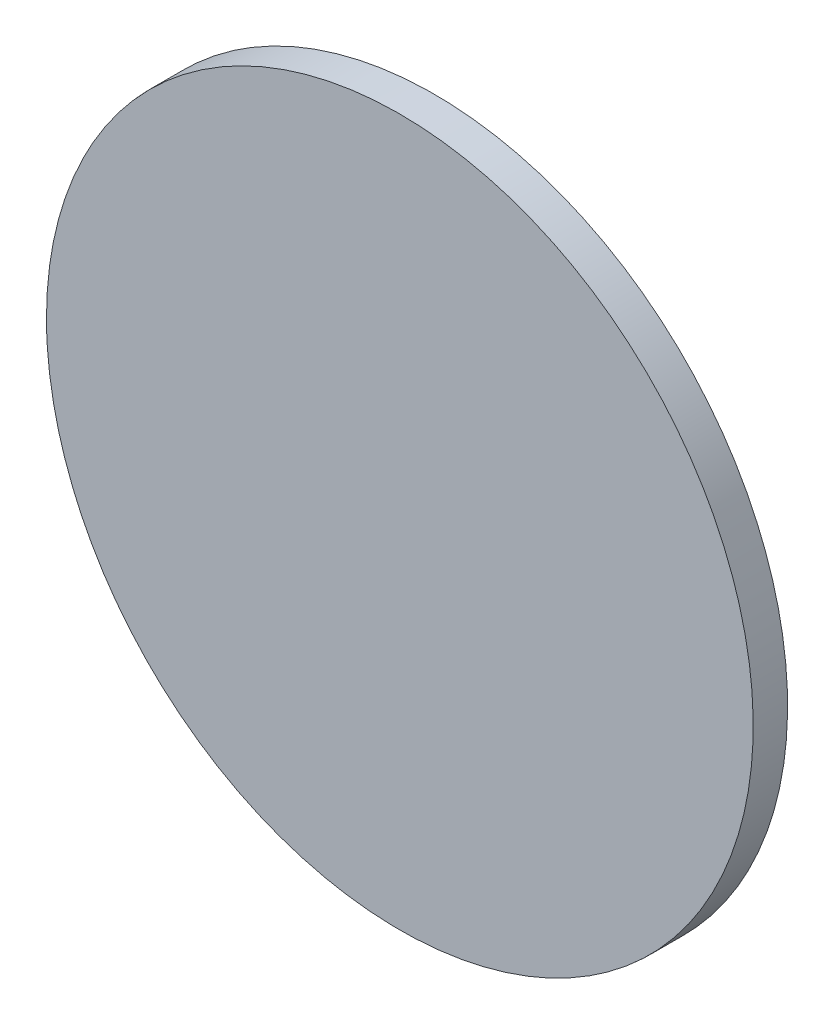
ISO-10303-21;
HEADER;
FILE_DESCRIPTION(('STEP AP214'),'2;1');
FILE_NAME('part.step','',(''),(''),'','','');
FILE_SCHEMA(('AUTOMOTIVE_DESIGN { 1 0 10303 214 1 1 1 1 }'));
ENDSEC;
DATA;
#1=APPLICATION_CONTEXT('core data for automotive mechanical design processes');
#2=APPLICATION_PROTOCOL_DEFINITION('international standard','automotive_design',2000,#1);
#3=PRODUCT_CONTEXT('',#1,'mechanical');
#4=PRODUCT('Part','Part','',(#3));
#5=PRODUCT_RELATED_PRODUCT_CATEGORY('part','',(#4));
#6=PRODUCT_DEFINITION_FORMATION('','',#4);
#7=PRODUCT_DEFINITION_CONTEXT('part definition',#1,'design');
#8=PRODUCT_DEFINITION('design','',#6,#7);
#9=PRODUCT_DEFINITION_SHAPE('','',#8);
#10=(LENGTH_UNIT() NAMED_UNIT(*) SI_UNIT(.MILLI.,.METRE.));
#11=(NAMED_UNIT(*) PLANE_ANGLE_UNIT() SI_UNIT($,.RADIAN.));
#12=(NAMED_UNIT(*) SI_UNIT($,.STERADIAN.) SOLID_ANGLE_UNIT());
#13=UNCERTAINTY_MEASURE_WITH_UNIT(LENGTH_MEASURE(1.E-05),#10,'distance_accuracy_value','');
#14=(GEOMETRIC_REPRESENTATION_CONTEXT(3) GLOBAL_UNCERTAINTY_ASSIGNED_CONTEXT((#13)) GLOBAL_UNIT_ASSIGNED_CONTEXT((#10,
#11,#12)) REPRESENTATION_CONTEXT('',''));
#15=CARTESIAN_POINT('',(0.,0.,0.));
#16=DIRECTION('',(0.,0.,1.));
#17=DIRECTION('',(1.,0.,0.));
#18=AXIS2_PLACEMENT_3D('',#15,#16,#17);
#19=CARTESIAN_POINT('',(-56.989807063411,51.5235974877803,-9881.36398621178));
#20=CARTESIAN_POINT('',(-56.989807063411,48.1585468177496,-9881.36398621178));
#21=CARTESIAN_POINT('',(-56.6591783859445,41.428445477688,-9881.36398621177));
#22=CARTESIAN_POINT('',(-55.1761255397013,31.4305153000243,-9881.36398621178));
#23=CARTESIAN_POINT('',(-52.7202454730431,21.6260924878247,-9881.36398621177));
#24=CARTESIAN_POINT('',(-49.3151896535325,12.1095989924134,-9881.36398621178));
#25=CARTESIAN_POINT('',(-44.9937506301042,2.97268384839567,-9881.36398621178));
#26=CARTESIAN_POINT('',(-39.7975462228926,-5.69665945664559,-9881.36398621178));
#27=CARTESIAN_POINT('',(-33.7766187208736,-13.8149404075378,-9881.36398621178));
#28=CARTESIAN_POINT('',(-26.9889529472652,-21.3039755208201,-9881.36398621178));
#29=CARTESIAN_POINT('',(-19.499917833983,-28.0916412944284,-9881.36398621178));
#30=CARTESIAN_POINT('',(-11.3816368830908,-34.1125687964475,-9881.36398621178));
#31=CARTESIAN_POINT('',(-2.7122935780495,-39.308773203659,-9881.36398621178));
#32=CARTESIAN_POINT('',(6.42462156596821,-43.6302122270874,-9881.36398621177));
#33=CARTESIAN_POINT('',(15.9411150613795,-47.035268046598,-9881.36398621178));
#34=CARTESIAN_POINT('',(25.7455378735791,-49.4911481132562,-9881.36398621178));
#35=CARTESIAN_POINT('',(35.7434680512428,-50.9742009594993,-9881.36398621178));
#36=CARTESIAN_POINT('',(45.8386200613352,-51.4701439756991,-9881.36398621178));
#37=CARTESIAN_POINT('',(55.9337720714275,-50.9742009594994,-9881.36398621178));
#38=CARTESIAN_POINT('',(65.9317022490912,-49.4911481132562,-9881.36398621177));
#39=CARTESIAN_POINT('',(75.7361250612908,-47.035268046598,-9881.36398621178));
#40=CARTESIAN_POINT('',(85.2526185567022,-43.6302122270874,-9881.36398621177));
#41=CARTESIAN_POINT('',(94.3895337007198,-39.3087732036591,-9881.36398621178));
#42=CARTESIAN_POINT('',(103.058877005761,-34.1125687964475,-9881.36398621178));
#43=CARTESIAN_POINT('',(111.177157956653,-28.0916412944285,-9881.36398621177));
#44=CARTESIAN_POINT('',(118.666193069936,-21.30397552082,-9881.36398621178));
#45=CARTESIAN_POINT('',(125.453858843544,-13.8149404075378,-9881.36398621177));
#46=CARTESIAN_POINT('',(131.474786345563,-5.69665945664559,-9881.36398621178));
#47=CARTESIAN_POINT('',(136.670990752775,2.97268384839566,-9881.36398621178));
#48=CARTESIAN_POINT('',(140.992429776203,12.1095989924133,-9881.36398621177));
#49=CARTESIAN_POINT('',(144.397485595714,21.6260924878247,-9881.36398621178));
#50=CARTESIAN_POINT('',(146.853365662372,31.4305153000242,-9881.36398621178));
#51=CARTESIAN_POINT('',(148.336418508615,41.428445477688,-9881.36398621178));
#52=CARTESIAN_POINT('',(148.832361524815,51.5235974877803,-9881.36398621178));
#53=CARTESIAN_POINT('',(148.336418508615,61.6187494978727,-9881.36398621178));
#54=CARTESIAN_POINT('',(146.853365662372,71.6166796755364,-9881.36398621178));
#55=CARTESIAN_POINT('',(144.397485595714,81.421102487736,-9881.36398621178));
#56=CARTESIAN_POINT('',(140.992429776203,90.9375959831473,-9881.36398621178));
#57=CARTESIAN_POINT('',(136.670990752775,100.074511127165,-9881.36398621178));
#58=CARTESIAN_POINT('',(131.474786345563,108.743854432206,-9881.36398621178));
#59=CARTESIAN_POINT('',(125.453858843544,116.862135383098,-9881.36398621178));
#60=CARTESIAN_POINT('',(118.666193069936,124.351170496381,-9881.36398621178));
#61=CARTESIAN_POINT('',(111.177157956653,131.138836269989,-9881.36398621178));
#62=CARTESIAN_POINT('',(103.058877005761,137.159763772008,-9881.36398621178));
#63=CARTESIAN_POINT('',(94.3895337007199,142.35596817922,-9881.36398621178));
#64=CARTESIAN_POINT('',(85.2526185567022,146.677407202648,-9881.36398621178));
#65=CARTESIAN_POINT('',(75.7361250612909,150.082463022159,-9881.36398621178));
#66=CARTESIAN_POINT('',(65.9317022490914,152.538343088817,-9881.36398621178));
#67=CARTESIAN_POINT('',(55.9337720714275,154.02139593506,-9881.36398621177));
#68=CARTESIAN_POINT('',(45.8386200613352,154.51733895126,-9881.36398621178));
#69=CARTESIAN_POINT('',(35.7434680512429,154.02139593506,-9881.36398621177));
#70=CARTESIAN_POINT('',(25.7455378735791,152.538343088817,-9881.36398621178));
#71=CARTESIAN_POINT('',(15.9411150613795,150.082463022159,-9881.36398621178));
#72=CARTESIAN_POINT('',(6.42462156596818,146.677407202648,-9881.36398621178));
#73=CARTESIAN_POINT('',(-2.71229357804946,142.35596817922,-9881.36398621177));
#74=CARTESIAN_POINT('',(-11.3816368830908,137.159763772008,-9881.36398621178));
#75=CARTESIAN_POINT('',(-19.4999178339829,131.138836269989,-9881.36398621177));
#76=CARTESIAN_POINT('',(-26.9889529472653,124.351170496381,-9881.36398621178));
#77=CARTESIAN_POINT('',(-33.7766187208736,116.862135383099,-9881.36398621177));
#78=CARTESIAN_POINT('',(-39.7975462228927,108.743854432206,-9881.36398621178));
#79=CARTESIAN_POINT('',(-44.9937506301041,100.074511127165,-9881.36398621178));
#80=CARTESIAN_POINT('',(-49.3151896535325,90.9375959831474,-9881.36398621178));
#81=CARTESIAN_POINT('',(-52.7202454730431,81.421102487736,-9881.36398621178));
#82=CARTESIAN_POINT('',(-55.1761255397013,71.6166796755365,-9881.36398621178));
#83=CARTESIAN_POINT('',(-56.6591783859445,61.6187494978726,-9881.36398621178));
#84=CARTESIAN_POINT('',(-56.989807063411,54.8886481578111,-9881.36398621178));
#85=CARTESIAN_POINT('',(-56.989807063411,51.5235974877803,-9881.36398621178));
#86=B_SPLINE_CURVE_WITH_KNOTS('',3,(#19,#20,#21,#22,#23,#24,#25,#26,#27,#28,#29,#30,#31,#32,#33,
#34,#35,#36,#37,#38,#39,#40,#41,#42,#43,#44,#45,#46,#47,#48,#49,#50,#51,#52,#53,#54,#55,#56,#57,
#58,#59,#60,#61,#62,#63,#64,#65,#66,#67,#68,#69,#70,#71,#72,#73,#74,#75,#76,#77,#78,#79,#80,#81,
#82,#83,#84,#85),.UNSPECIFIED.,.T.,.F.,(4,1,1,1,1,1,1,1,1,1,1,1,1,1,1,1,1,1,1,1,1,1,1,1,1,1,1,1,
1,1,1,1,1,1,1,1,1,1,1,1,1,1,1,1,1,1,1,1,1,1,1,1,1,1,1,1,1,1,1,1,1,1,1,1,4),(0.,0.015625,0.03125,
0.046875,0.0625,0.078125,0.0937500000000001,0.109375,0.125,0.140625,0.15625,0.171875,0.1875,
0.203125,0.21875,0.234375,0.25,0.265625,0.28125,0.296875,0.3125,0.328125,0.34375,0.359375,0.375,
0.390625,0.40625,0.421875,0.4375,0.453125,0.46875,0.484375,0.5,0.515625,0.53125,0.546875,0.5625,
0.578125,0.59375,0.609375,0.625,0.640625,0.65625,0.671875,0.6875,0.703125,0.71875,0.734375,0.75,
0.765625,0.78125,0.796875,0.8125,0.828125,0.84375,0.859375,0.875,0.890625,0.90625,0.921875,
0.9375,0.953125,0.96875,0.984375,1.),.UNSPECIFIED.);
#87=DIRECTION('',(0.,0.,-1.));
#88=VECTOR('',#87,1.);
#89=SURFACE_OF_LINEAR_EXTRUSION('',#86,#88);
#90=CARTESIAN_POINT('',(-56.989807063411,51.5235974877803,-9881.36398621178));
#91=CARTESIAN_POINT('',(-56.989807063411,53.2061228227957,-9881.36398621178));
#92=CARTESIAN_POINT('',(-56.9484784787277,54.8886481578111,-9881.36398621178));
#93=CARTESIAN_POINT('',(-56.783363148426,58.2496479181574,-9881.36398621178));
#94=CARTESIAN_POINT('',(-56.6595764028075,59.9281223434882,-9881.36398621178));
#95=CARTESIAN_POINT('',(-56.329743759067,63.2769693747809,-9881.36398621178));
#96=CARTESIAN_POINT('',(-56.123697860945,64.9473419807427,-9881.36398621178));
#97=CARTESIAN_POINT('',(-55.6299420209318,68.2759734760875,-9881.36398621178));
#98=CARTESIAN_POINT('',(-55.3422320790406,69.9342323654705,-9881.36398621177));
#99=CARTESIAN_POINT('',(-54.6857432602237,73.2346245304477,-9881.36398621177));
#100=CARTESIAN_POINT('',(-54.316964383298,74.876757806042,-9881.36398621178));
#101=CARTESIAN_POINT('',(-53.499323172227,78.14096449547,-9881.36398621178));
#102=CARTESIAN_POINT('',(-53.0504608380818,79.7630379093037,-9881.36398621177));
#103=CARTESIAN_POINT('',(-52.073638190387,82.9831906272389,-9881.36398621177));
#104=CARTESIAN_POINT('',(-51.5456778768374,84.5812699313403,-9881.36398621177));
#105=CARTESIAN_POINT('',(-50.4120256265395,87.7496157200355,-9881.36398621177));
#106=CARTESIAN_POINT('',(-49.8063336897911,89.3198822046294,-9881.36398621178));
#107=CARTESIAN_POINT('',(-48.5185845493013,92.4287836445342,-9881.36398621178));
#108=CARTESIAN_POINT('',(-47.8365273455598,93.9674185998452,-9881.36398621178));
#109=CARTESIAN_POINT('',(-46.3977817469226,97.0093905858685,-9881.36398621178));
#110=CARTESIAN_POINT('',(-45.6410933520269,98.5127276165807,-9881.36398621178));
#111=CARTESIAN_POINT('',(-44.0548194469203,101.480437358091,-9881.36398621178));
#112=CARTESIAN_POINT('',(-43.2252339367093,102.944810068888,-9881.36398621178));
#113=CARTESIAN_POINT('',(-41.4952508963461,105.831112399103,-9881.36398621178));
#114=CARTESIAN_POINT('',(-40.5948533661939,107.25304201852,-9881.36398621178));
#115=CARTESIAN_POINT('',(-38.7253313813221,110.050979394509,-9881.36398621178));
#116=CARTESIAN_POINT('',(-37.7562069266026,111.426987151081,-9881.36398621177));
#117=CARTESIAN_POINT('',(-35.751647126897,114.129823156234,-9881.36398621177));
#118=CARTESIAN_POINT('',(-34.7162117819109,115.456651404816,-9881.36398621177));
#119=CARTESIAN_POINT('',(-32.581446235973,118.057870748845,-9881.36398621177));
#120=CARTESIAN_POINT('',(-31.4821160350212,119.332261844292,-9881.36398621177));
#121=CARTESIAN_POINT('',(-29.2222844826482,121.825601736134,-9881.36398621177));
#122=CARTESIAN_POINT('',(-28.0617831312271,123.044550532528,-9881.36398621177));
#123=CARTESIAN_POINT('',(-25.6823329834119,125.424000680343,-9881.36398621177));
#124=CARTESIAN_POINT('',(-24.463384187018,126.584502031764,-9881.36398621177));
#125=CARTESIAN_POINT('',(-21.9700442951765,128.844333584137,-9881.36398621177));
#126=CARTESIAN_POINT('',(-20.6956531997291,129.943663785089,-9881.36398621177));
#127=CARTESIAN_POINT('',(-18.0944338557,132.078429331027,-9881.36398621177));
#128=CARTESIAN_POINT('',(-16.7676056071184,133.113864676013,-9881.36398621177));
#129=CARTESIAN_POINT('',(-14.0647696019652,135.118424475718,-9881.36398621177));
#130=CARTESIAN_POINT('',(-12.6887618453936,136.087548930438,-9881.36398621178));
#131=CARTESIAN_POINT('',(-9.89082446940469,137.95707091531,-9881.36398621178));
#132=CARTESIAN_POINT('',(-8.46889484998735,138.857468445462,-9881.36398621178));
#133=CARTESIAN_POINT('',(-5.58259251977244,140.587451485825,-9881.36398621177));
#134=CARTESIAN_POINT('',(-4.11821980897487,141.417036996036,-9881.36398621177));
#135=CARTESIAN_POINT('',(-1.15051006746502,143.003310901143,-9881.36398621177));
#136=CARTESIAN_POINT('',(0.352826963247251,143.759999296038,-9881.36398621177));
#137=CARTESIAN_POINT('',(3.39479894927054,145.198744894675,-9881.36398621178));
#138=CARTESIAN_POINT('',(4.93343390458156,145.880802098417,-9881.36398621178));
#139=CARTESIAN_POINT('',(8.0423353444864,147.168551238907,-9881.36398621178));
#140=CARTESIAN_POINT('',(9.61260182908023,147.774243175655,-9881.36398621178));
#141=CARTESIAN_POINT('',(12.7809476177755,148.907895425953,-9881.36398621178));
#142=CARTESIAN_POINT('',(14.3790269218769,149.435855739503,-9881.36398621177));
#143=CARTESIAN_POINT('',(17.599179639812,150.412678387197,-9881.36398621177));
#144=CARTESIAN_POINT('',(19.2212530536458,150.861540721343,-9881.36398621178));
#145=CARTESIAN_POINT('',(22.4854597430738,151.679181932414,-9881.36398621178));
#146=CARTESIAN_POINT('',(24.1275930186681,152.047960809339,-9881.36398621177));
#147=CARTESIAN_POINT('',(27.4279851836453,152.704449628156,-9881.36398621177));
#148=CARTESIAN_POINT('',(29.0862440730282,152.992159570047,-9881.36398621177));
#149=CARTESIAN_POINT('',(32.414875568373,153.48591541006,-9881.36398621177));
#150=CARTESIAN_POINT('',(34.0852481743348,153.691961308183,-9881.36398621177));
#151=CARTESIAN_POINT('',(37.4340952056275,154.021793951923,-9881.36398621177));
#152=CARTESIAN_POINT('',(39.1125696309583,154.145580697541,-9881.36398621177));
#153=CARTESIAN_POINT('',(42.4735693913046,154.310696027843,-9881.36398621177));
#154=CARTESIAN_POINT('',(44.15609472632,154.352024612527,-9881.36398621178));
#155=CARTESIAN_POINT('',(47.5211453963508,154.352024612527,-9881.36398621178));
#156=CARTESIAN_POINT('',(49.2036707313661,154.310696027843,-9881.36398621178));
#157=CARTESIAN_POINT('',(52.5646704917124,154.145580697541,-9881.36398621177));
#158=CARTESIAN_POINT('',(54.2431449170433,154.021793951923,-9881.36398621177));
#159=CARTESIAN_POINT('',(57.591991948336,153.691961308182,-9881.36398621177));
#160=CARTESIAN_POINT('',(59.2623645542978,153.48591541006,-9881.36398621177));
#161=CARTESIAN_POINT('',(62.5909960496426,152.992159570047,-9881.36398621178));
#162=CARTESIAN_POINT('',(64.2492549390255,152.704449628156,-9881.36398621178));
#163=CARTESIAN_POINT('',(67.5496471040028,152.047960809339,-9881.36398621178));
#164=CARTESIAN_POINT('',(69.191780379597,151.679181932413,-9881.36398621178));
#165=CARTESIAN_POINT('',(72.455987069025,150.861540721342,-9881.36398621178));
#166=CARTESIAN_POINT('',(74.0780604828587,150.412678387197,-9881.36398621178));
#167=CARTESIAN_POINT('',(77.2982132007939,149.435855739502,-9881.36398621178));
#168=CARTESIAN_POINT('',(78.8962925048953,148.907895425953,-9881.36398621178));
#169=CARTESIAN_POINT('',(82.0646382935905,147.774243175655,-9881.36398621178));
#170=CARTESIAN_POINT('',(83.6349047781843,147.168551238907,-9881.36398621178));
#171=CARTESIAN_POINT('',(86.7438062180891,145.880802098417,-9881.36398621178));
#172=CARTESIAN_POINT('',(88.2824411734002,145.198744894675,-9881.36398621177));
#173=CARTESIAN_POINT('',(91.3244131594235,143.759999296038,-9881.36398621177));
#174=CARTESIAN_POINT('',(92.8277501901357,143.003310901142,-9881.36398621177));
#175=CARTESIAN_POINT('',(95.7954599316456,141.417036996036,-9881.36398621177));
#176=CARTESIAN_POINT('',(97.2598326424431,140.587451485825,-9881.36398621178));
#177=CARTESIAN_POINT('',(100.146134972658,138.857468445462,-9881.36398621178));
#178=CARTESIAN_POINT('',(101.568064592075,137.957070915309,-9881.36398621178));
#179=CARTESIAN_POINT('',(104.366001968064,136.087548930438,-9881.36398621178));
#180=CARTESIAN_POINT('',(105.742009724636,135.118424475718,-9881.36398621178));
#181=CARTESIAN_POINT('',(108.444845729789,133.113864676012,-9881.36398621178));
#182=CARTESIAN_POINT('',(109.771673978371,132.078429331026,-9881.36398621178));
#183=CARTESIAN_POINT('',(112.3728933224,129.943663785088,-9881.36398621178));
#184=CARTESIAN_POINT('',(113.647284417847,128.844333584137,-9881.36398621178));
#185=CARTESIAN_POINT('',(116.140624309689,126.584502031764,-9881.36398621178));
#186=CARTESIAN_POINT('',(117.359573106083,125.424000680343,-9881.36398621178));
#187=CARTESIAN_POINT('',(119.739023253898,123.044550532527,-9881.36398621178));
#188=CARTESIAN_POINT('',(120.899524605319,121.825601736133,-9881.36398621177));
#189=CARTESIAN_POINT('',(123.159356157692,119.332261844292,-9881.36398621177));
#190=CARTESIAN_POINT('',(124.258686358644,118.057870748845,-9881.36398621178));
#191=CARTESIAN_POINT('',(126.393451904582,115.456651404815,-9881.36398621178));
#192=CARTESIAN_POINT('',(127.428887249568,114.129823156234,-9881.36398621178));
#193=CARTESIAN_POINT('',(129.433447049273,111.426987151081,-9881.36398621178));
#194=CARTESIAN_POINT('',(130.402571503993,110.050979394509,-9881.36398621178));
#195=CARTESIAN_POINT('',(132.272093488864,107.25304201852,-9881.36398621178));
#196=CARTESIAN_POINT('',(133.172491019017,105.831112399103,-9881.36398621178));
#197=CARTESIAN_POINT('',(134.90247405938,102.944810068888,-9881.36398621178));
#198=CARTESIAN_POINT('',(135.732059569591,101.48043735809,-9881.36398621178));
#199=CARTESIAN_POINT('',(137.318333474697,98.5127276165805,-9881.36398621178));
#200=CARTESIAN_POINT('',(138.075021869593,97.0093905858682,-9881.36398621178));
#201=CARTESIAN_POINT('',(139.51376746823,93.967418599845,-9881.36398621178));
#202=CARTESIAN_POINT('',(140.195824671972,92.428783644534,-9881.36398621178));
#203=CARTESIAN_POINT('',(141.483573812462,89.3198822046291,-9881.36398621178));
#204=CARTESIAN_POINT('',(142.08926574921,87.7496157200353,-9881.36398621178));
#205=CARTESIAN_POINT('',(143.222917999508,84.5812699313401,-9881.36398621178));
#206=CARTESIAN_POINT('',(143.750878313057,82.9831906272387,-9881.36398621178));
#207=CARTESIAN_POINT('',(144.727700960752,79.7630379093036,-9881.36398621178));
#208=CARTESIAN_POINT('',(145.176563294897,78.1409644954698,-9881.36398621178));
#209=CARTESIAN_POINT('',(145.994204505968,74.8767578060418,-9881.36398621178));
#210=CARTESIAN_POINT('',(146.362983382894,73.2346245304475,-9881.36398621178));
#211=CARTESIAN_POINT('',(147.019472201711,69.9342323654703,-9881.36398621178));
#212=CARTESIAN_POINT('',(147.307182143602,68.2759734760874,-9881.36398621178));
#213=CARTESIAN_POINT('',(147.800937983615,64.9473419807426,-9881.36398621178));
#214=CARTESIAN_POINT('',(148.006983881737,63.2769693747808,-9881.36398621178));
#215=CARTESIAN_POINT('',(148.336816525478,59.9281223434881,-9881.36398621178));
#216=CARTESIAN_POINT('',(148.460603271096,58.2496479181572,-9881.36398621178));
#217=CARTESIAN_POINT('',(148.625718601398,54.888648157811,-9881.36398621178));
#218=CARTESIAN_POINT('',(148.667047186081,53.2061228227956,-9881.36398621178));
#219=CARTESIAN_POINT('',(148.667047186081,49.8410721527648,-9881.36398621178));
#220=CARTESIAN_POINT('',(148.625718601398,48.1585468177494,-9881.36398621178));
#221=CARTESIAN_POINT('',(148.460603271096,44.7975470574031,-9881.36398621178));
#222=CARTESIAN_POINT('',(148.336816525478,43.1190726320723,-9881.36398621178));
#223=CARTESIAN_POINT('',(148.006983881737,39.7702256007796,-9881.36398621178));
#224=CARTESIAN_POINT('',(147.800937983615,38.0998529948178,-9881.36398621178));
#225=CARTESIAN_POINT('',(147.307182143602,34.771221499473,-9881.36398621178));
#226=CARTESIAN_POINT('',(147.019472201711,33.1129626100901,-9881.36398621177));
#227=CARTESIAN_POINT('',(146.362983382894,29.8125704451129,-9881.36398621177));
#228=CARTESIAN_POINT('',(145.994204505968,28.1704371695186,-9881.36398621177));
#229=CARTESIAN_POINT('',(145.176563294897,24.9062304800906,-9881.36398621177));
#230=CARTESIAN_POINT('',(144.727700960752,23.2841570662568,-9881.36398621177));
#231=CARTESIAN_POINT('',(143.750878313057,20.0640043483217,-9881.36398621177));
#232=CARTESIAN_POINT('',(143.222917999508,18.4659250442203,-9881.36398621177));
#233=CARTESIAN_POINT('',(142.08926574921,15.297579255525,-9881.36398621177));
#234=CARTESIAN_POINT('',(141.483573812461,13.7273127709312,-9881.36398621177));
#235=CARTESIAN_POINT('',(140.195824671972,10.6184113310264,-9881.36398621177));
#236=CARTESIAN_POINT('',(139.51376746823,9.07977637571536,-9881.36398621177));
#237=CARTESIAN_POINT('',(138.075021869593,6.03780438969208,-9881.36398621177));
#238=CARTESIAN_POINT('',(137.318333474697,4.53446735897982,-9881.36398621178));
#239=CARTESIAN_POINT('',(135.732059569591,1.56675761747,-9881.36398621178));
#240=CARTESIAN_POINT('',(134.90247405938,0.10238490667244,-9881.36398621178));
#241=CARTESIAN_POINT('',(133.172491019016,-2.78391742354245,-9881.36398621178));
#242=CARTESIAN_POINT('',(132.272093488864,-4.20584704295979,-9881.36398621178));
#243=CARTESIAN_POINT('',(130.402571503992,-7.0037844189487,-9881.36398621178));
#244=CARTESIAN_POINT('',(129.433447049273,-8.37979217552027,-9881.36398621177));
#245=CARTESIAN_POINT('',(127.428887249567,-11.0826281806735,-9881.36398621177));
#246=CARTESIAN_POINT('',(126.393451904581,-12.4094564292551,-9881.36398621177));
#247=CARTESIAN_POINT('',(124.258686358643,-15.0106757732842,-9881.36398621177));
#248=CARTESIAN_POINT('',(123.159356157691,-16.2850668687316,-9881.36398621177));
#249=CARTESIAN_POINT('',(120.899524605319,-18.778406760573,-9881.36398621177));
#250=CARTESIAN_POINT('',(119.739023253897,-19.997355556967,-9881.36398621177));
#251=CARTESIAN_POINT('',(117.359573106082,-22.3768057047821,-9881.36398621177));
#252=CARTESIAN_POINT('',(116.140624309688,-23.5373070562032,-9881.36398621177));
#253=CARTESIAN_POINT('',(113.647284417847,-25.7971386085762,-9881.36398621177));
#254=CARTESIAN_POINT('',(112.372893322399,-26.896468809528,-9881.36398621177));
#255=CARTESIAN_POINT('',(109.77167397837,-29.0312343554659,-9881.36398621177));
#256=CARTESIAN_POINT('',(108.444845729789,-30.066669700452,-9881.36398621178));
#257=CARTESIAN_POINT('',(105.742009724636,-32.0712295001576,-9881.36398621178));
#258=CARTESIAN_POINT('',(104.366001968064,-33.0403539548771,-9881.36398621178));
#259=CARTESIAN_POINT('',(101.568064592075,-34.9098759397489,-9881.36398621178));
#260=CARTESIAN_POINT('',(100.146134972658,-35.8102734699011,-9881.36398621178));
#261=CARTESIAN_POINT('',(97.2598326424428,-37.5402565102643,-9881.36398621178));
#262=CARTESIAN_POINT('',(95.7954599316452,-38.3698420204753,-9881.36398621178));
#263=CARTESIAN_POINT('',(92.8277501901354,-39.9561159255819,-9881.36398621178));
#264=CARTESIAN_POINT('',(91.3244131594231,-40.7128043204776,-9881.36398621178));
#265=CARTESIAN_POINT('',(88.2824411733999,-42.1515499191148,-9881.36398621178));
#266=CARTESIAN_POINT('',(86.7438062180888,-42.8336071228563,-9881.36398621177));
#267=CARTESIAN_POINT('',(83.634904778184,-44.1213562633461,-9881.36398621177));
#268=CARTESIAN_POINT('',(82.0646382935902,-44.7270482000944,-9881.36398621177));
#269=CARTESIAN_POINT('',(78.896292504895,-45.8607004503923,-9881.36398621177));
#270=CARTESIAN_POINT('',(77.2982132007936,-46.3886607639419,-9881.36398621177));
#271=CARTESIAN_POINT('',(74.0780604828584,-47.3654834116367,-9881.36398621177));
#272=CARTESIAN_POINT('',(72.4559870690247,-47.8143457457819,-9881.36398621177));
#273=CARTESIAN_POINT('',(69.1917803795966,-48.6319869568528,-9881.36398621177));
#274=CARTESIAN_POINT('',(67.5496471040024,-49.0007658337786,-9881.36398621177));
#275=CARTESIAN_POINT('',(64.2492549390251,-49.6572546525955,-9881.36398621177));
#276=CARTESIAN_POINT('',(62.5909960496422,-49.9449645944866,-9881.36398621177));
#277=CARTESIAN_POINT('',(59.2623645542974,-50.4387204344998,-9881.36398621177));
#278=CARTESIAN_POINT('',(57.5919919483356,-50.6447663326219,-9881.36398621178));
#279=CARTESIAN_POINT('',(54.2431449170429,-50.9745989763624,-9881.36398621178));
#280=CARTESIAN_POINT('',(52.5646704917121,-51.0983857219808,-9881.36398621177));
#281=CARTESIAN_POINT('',(49.2036707313658,-51.2635010522825,-9881.36398621177));
#282=CARTESIAN_POINT('',(47.5211453963505,-51.3048296369659,-9881.36398621178));
#283=CARTESIAN_POINT('',(44.1560947263197,-51.3048296369659,-9881.36398621178));
#284=CARTESIAN_POINT('',(42.4735693913043,-51.2635010522825,-9881.36398621177));
#285=CARTESIAN_POINT('',(39.112569630958,-51.0983857219808,-9881.36398621177));
#286=CARTESIAN_POINT('',(37.4340952056272,-50.9745989763624,-9881.36398621177));
#287=CARTESIAN_POINT('',(34.0852481743345,-50.6447663326219,-9881.36398621178));
#288=CARTESIAN_POINT('',(32.4148755683727,-50.4387204344998,-9881.36398621178));
#289=CARTESIAN_POINT('',(29.0862440730279,-49.9449645944866,-9881.36398621178));
#290=CARTESIAN_POINT('',(27.427985183645,-49.6572546525954,-9881.36398621177));
#291=CARTESIAN_POINT('',(24.1275930186678,-49.0007658337785,-9881.36398621177));
#292=CARTESIAN_POINT('',(22.4854597430735,-48.6319869568528,-9881.36398621177));
#293=CARTESIAN_POINT('',(19.2212530536455,-47.8143457457818,-9881.36398621177));
#294=CARTESIAN_POINT('',(17.5991796398117,-47.3654834116366,-9881.36398621177));
#295=CARTESIAN_POINT('',(14.3790269218766,-46.3886607639418,-9881.36398621177));
#296=CARTESIAN_POINT('',(12.7809476177752,-45.8607004503923,-9881.36398621177));
#297=CARTESIAN_POINT('',(9.61260182907998,-44.7270482000943,-9881.36398621177));
#298=CARTESIAN_POINT('',(8.04233534448616,-44.121356263346,-9881.36398621177));
#299=CARTESIAN_POINT('',(4.93343390458133,-42.8336071228562,-9881.36398621177));
#300=CARTESIAN_POINT('',(3.39479894927032,-42.1515499191147,-9881.36398621177));
#301=CARTESIAN_POINT('',(0.352826963247039,-40.7128043204775,-9881.36398621177));
#302=CARTESIAN_POINT('',(-1.15051006746523,-39.9561159255818,-9881.36398621177));
#303=CARTESIAN_POINT('',(-4.11821980897505,-38.3698420204751,-9881.36398621177));
#304=CARTESIAN_POINT('',(-5.58259251977261,-37.5402565102642,-9881.36398621178));
#305=CARTESIAN_POINT('',(-8.46889484998751,-35.810273469901,-9881.36398621178));
#306=CARTESIAN_POINT('',(-9.89082446940484,-34.9098759397488,-9881.36398621178));
#307=CARTESIAN_POINT('',(-12.6887618453938,-33.040353954877,-9881.36398621178));
#308=CARTESIAN_POINT('',(-14.0647696019653,-32.0712295001575,-9881.36398621178));
#309=CARTESIAN_POINT('',(-16.7676056071185,-30.0666697004519,-9881.36398621178));
#310=CARTESIAN_POINT('',(-18.0944338557001,-29.0312343554658,-9881.36398621178));
#311=CARTESIAN_POINT('',(-20.6956531997292,-26.8964688095279,-9881.36398621178));
#312=CARTESIAN_POINT('',(-21.9700442951767,-25.7971386085761,-9881.36398621177));
#313=CARTESIAN_POINT('',(-24.4633841870181,-23.5373070562031,-9881.36398621177));
#314=CARTESIAN_POINT('',(-25.6823329834121,-22.3768057047819,-9881.36398621177));
#315=CARTESIAN_POINT('',(-28.0617831312272,-19.9973555569668,-9881.36398621177));
#316=CARTESIAN_POINT('',(-29.2222844826483,-18.7784067605729,-9881.36398621177));
#317=CARTESIAN_POINT('',(-31.4821160350213,-16.2850668687314,-9881.36398621177));
#318=CARTESIAN_POINT('',(-32.5814462359731,-15.010675773284,-9881.36398621177));
#319=CARTESIAN_POINT('',(-34.716211781911,-12.4094564292549,-9881.36398621177));
#320=CARTESIAN_POINT('',(-35.7516471268971,-11.0826281806733,-9881.36398621177));
#321=CARTESIAN_POINT('',(-37.7562069266027,-8.37979217552009,-9881.36398621177));
#322=CARTESIAN_POINT('',(-38.7253313813222,-7.00378441894851,-9881.36398621177));
#323=CARTESIAN_POINT('',(-40.594853366194,-4.2058470429596,-9881.36398621177));
#324=CARTESIAN_POINT('',(-41.4952508963462,-2.78391742354226,-9881.36398621177));
#325=CARTESIAN_POINT('',(-43.2252339367094,0.102384906672631,-9881.36398621177));
#326=CARTESIAN_POINT('',(-44.0548194469204,1.56675761747019,-9881.36398621177));
#327=CARTESIAN_POINT('',(-45.641093352027,4.53446735898002,-9881.36398621177));
#328=CARTESIAN_POINT('',(-46.3977817469227,6.03780438969228,-9881.36398621177));
#329=CARTESIAN_POINT('',(-47.8365273455599,9.07977637571556,-9881.36398621177));
#330=CARTESIAN_POINT('',(-48.5185845493013,10.6184113310266,-9881.36398621177));
#331=CARTESIAN_POINT('',(-49.8063336897912,13.7273127709314,-9881.36398621177));
#332=CARTESIAN_POINT('',(-50.4120256265395,15.2975792555252,-9881.36398621177));
#333=CARTESIAN_POINT('',(-51.5456778768374,18.4659250442204,-9881.36398621177));
#334=CARTESIAN_POINT('',(-52.073638190387,20.0640043483218,-9881.36398621177));
#335=CARTESIAN_POINT('',(-53.0504608380818,23.284157066257,-9881.36398621177));
#336=CARTESIAN_POINT('',(-53.499323172227,24.9062304800907,-9881.36398621177));
#337=CARTESIAN_POINT('',(-54.316964383298,28.1704371695187,-9881.36398621177));
#338=CARTESIAN_POINT('',(-54.6857432602237,29.812570445113,-9881.36398621177));
#339=CARTESIAN_POINT('',(-55.3422320790406,33.1129626100902,-9881.36398621177));
#340=CARTESIAN_POINT('',(-55.6299420209318,34.7712214994732,-9881.36398621177));
#341=CARTESIAN_POINT('',(-56.123697860945,38.0998529948179,-9881.36398621177));
#342=CARTESIAN_POINT('',(-56.329743759067,39.7702256007798,-9881.36398621177));
#343=CARTESIAN_POINT('',(-56.6595764028075,43.1190726320724,-9881.36398621177));
#344=CARTESIAN_POINT('',(-56.783363148426,44.7975470574033,-9881.36398621177));
#345=CARTESIAN_POINT('',(-56.9484784787277,48.1585468177496,-9881.36398621178));
#346=CARTESIAN_POINT('',(-56.989807063411,49.841072152765,-9881.36398621178));
#347=CARTESIAN_POINT('',(-56.989807063411,51.5235974877803,-9881.36398621178));
#348=B_SPLINE_CURVE_WITH_KNOTS('',3,(#90,#91,#92,#93,#94,#95,#96,#97,#98,#99,#100,#101,#102,
#103,#104,#105,#106,#107,#108,#109,#110,#111,#112,#113,#114,#115,#116,#117,#118,#119,#120,#121,
#122,#123,#124,#125,#126,#127,#128,#129,#130,#131,#132,#133,#134,#135,#136,#137,#138,#139,#140,
#141,#142,#143,#144,#145,#146,#147,#148,#149,#150,#151,#152,#153,#154,#155,#156,#157,#158,#159,
#160,#161,#162,#163,#164,#165,#166,#167,#168,#169,#170,#171,#172,#173,#174,#175,#176,#177,#178,
#179,#180,#181,#182,#183,#184,#185,#186,#187,#188,#189,#190,#191,#192,#193,#194,#195,#196,#197,
#198,#199,#200,#201,#202,#203,#204,#205,#206,#207,#208,#209,#210,#211,#212,#213,#214,#215,#216,
#217,#218,#219,#220,#221,#222,#223,#224,#225,#226,#227,#228,#229,#230,#231,#232,#233,#234,#235,
#236,#237,#238,#239,#240,#241,#242,#243,#244,#245,#246,#247,#248,#249,#250,#251,#252,#253,#254,
#255,#256,#257,#258,#259,#260,#261,#262,#263,#264,#265,#266,#267,#268,#269,#270,#271,#272,#273,
#274,#275,#276,#277,#278,#279,#280,#281,#282,#283,#284,#285,#286,#287,#288,#289,#290,#291,#292,
#293,#294,#295,#296,#297,#298,#299,#300,#301,#302,#303,#304,#305,#306,#307,#308,#309,#310,#311,
#312,#313,#314,#315,#316,#317,#318,#319,#320,#321,#322,#323,#324,#325,#326,#327,#328,#329,#330,
#331,#332,#333,#334,#335,#336,#337,#338,#339,#340,#341,#342,#343,#344,#345,#346,#347),
.UNSPECIFIED.,.F.,.F.,(4,2,2,2,2,2,2,2,2,2,2,2,2,2,2,2,2,2,2,2,2,2,2,2,2,2,2,2,2,2,2,2,2,2,2,2,
2,2,2,2,2,2,2,2,2,2,2,2,2,2,2,2,2,2,2,2,2,2,2,2,2,2,2,2,2,2,2,2,2,2,2,2,2,2,2,2,2,2,2,2,2,2,2,2,
2,2,2,2,2,2,2,2,2,2,2,2,2,2,2,2,2,2,2,2,2,2,2,2,2,2,2,2,2,2,2,2,2,2,2,2,2,2,2,2,2,2,2,2,4),(0.,
5.0470712455404,10.0941424910808,15.1412137366213,20.1882849821617,25.2353562277021,
30.2824274732426,35.329498718783,40.3765699643235,45.4236412098639,50.4707124554043,
55.5177837009447,60.5648549464852,65.6119261920256,70.658997437566,75.7060686831065,
80.7531399286469,85.8002111741873,90.8472824197277,95.8943536652682,100.941424910809,
105.988496156349,111.035567401889,116.08263864743,121.12970989297,126.176781138511,
131.223852384051,136.270923629592,141.317994875132,146.365066120672,151.412137366213,
156.459208611753,161.506279857294,166.553351102834,171.600422348375,176.647493593915,
181.694564839455,186.741636084996,191.788707330536,196.835778576077,201.882849821617,
206.929921067158,211.976992312698,217.024063558238,222.071134803779,227.118206049319,
232.16527729486,237.2123485404,242.259419785941,247.306491031481,252.353562277021,
257.400633522562,262.447704768102,267.494776013643,272.541847259183,277.588918504723,
282.635989750264,287.683060995804,292.730132241345,297.777203486885,302.824274732426,
307.871345977966,312.918417223506,317.965488469047,323.012559714587,328.059630960128,
333.106702205668,338.153773451209,343.200844696749,348.247915942289,353.29498718783,
358.34205843337,363.389129678911,368.436200924451,373.483272169992,378.530343415532,
383.577414661073,388.624485906613,393.671557152153,398.718628397694,403.765699643234,
408.812770888775,413.859842134315,418.906913379855,423.953984625396,429.001055870936,
434.048127116477,439.095198362017,444.142269607558,449.189340853098,454.236412098639,
459.283483344179,464.330554589719,469.37762583526,474.4246970808,479.471768326341,
484.518839571881,489.565910817422,494.612982062962,499.660053308502,504.707124554043,
509.754195799583,514.801267045123,519.848338290664,524.895409536204,529.942480781745,
534.989552027285,540.036623272825,545.083694518366,550.130765763906,555.177837009447,
560.224908254987,565.271979500527,570.319050746068,575.366121991608,580.413193237148,
585.460264482689,590.507335728229,595.55440697377,600.60147821931,605.64854946485,
610.695620710391,615.742691955931,620.789763201471,625.836834447012,630.883905692552,
635.930976938093,640.978048183633,646.025119429173),.UNSPECIFIED.);
#349=CARTESIAN_POINT('',(-56.989807063411,51.5235974877803,-9881.36398621178));
#350=VERTEX_POINT('',#349);
#351=EDGE_CURVE('E9',#350,#350,#348,.F.);
#352=ORIENTED_EDGE('',*,*,#351,.F.);
#353=EDGE_LOOP('',(#352));
#354=FACE_BOUND('',#353,.T.);
#355=CARTESIAN_POINT('',(-56.989807063411,51.5235974877803,-9891.36398621178));
#356=CARTESIAN_POINT('',(-56.989807063411,48.1585468177496,-9891.36398621178));
#357=CARTESIAN_POINT('',(-56.6591783859445,41.428445477688,-9891.36398621177));
#358=CARTESIAN_POINT('',(-55.1761255397013,31.4305153000243,-9891.36398621178));
#359=CARTESIAN_POINT('',(-52.7202454730431,21.6260924878247,-9891.36398621177));
#360=CARTESIAN_POINT('',(-49.3151896535325,12.1095989924134,-9891.36398621177));
#361=CARTESIAN_POINT('',(-44.9937506301042,2.97268384839567,-9891.36398621177));
#362=CARTESIAN_POINT('',(-39.7975462228926,-5.69665945664559,-9891.36398621177));
#363=CARTESIAN_POINT('',(-33.7766187208736,-13.8149404075378,-9891.36398621177));
#364=CARTESIAN_POINT('',(-26.9889529472652,-21.3039755208201,-9891.36398621177));
#365=CARTESIAN_POINT('',(-19.499917833983,-28.0916412944284,-9891.36398621177));
#366=CARTESIAN_POINT('',(-11.3816368830908,-34.1125687964475,-9891.36398621178));
#367=CARTESIAN_POINT('',(-2.7122935780495,-39.308773203659,-9891.36398621177));
#368=CARTESIAN_POINT('',(6.42462156596821,-43.6302122270874,-9891.36398621177));
#369=CARTESIAN_POINT('',(15.9411150613795,-47.035268046598,-9891.36398621177));
#370=CARTESIAN_POINT('',(25.7455378735791,-49.4911481132562,-9891.36398621177));
#371=CARTESIAN_POINT('',(35.7434680512428,-50.9742009594993,-9891.36398621177));
#372=CARTESIAN_POINT('',(45.8386200613352,-51.4701439756991,-9891.36398621177));
#373=CARTESIAN_POINT('',(55.9337720714275,-50.9742009594994,-9891.36398621178));
#374=CARTESIAN_POINT('',(65.9317022490912,-49.4911481132562,-9891.36398621177));
#375=CARTESIAN_POINT('',(75.7361250612908,-47.035268046598,-9891.36398621178));
#376=CARTESIAN_POINT('',(85.2526185567022,-43.6302122270874,-9891.36398621177));
#377=CARTESIAN_POINT('',(94.3895337007198,-39.3087732036591,-9891.36398621178));
#378=CARTESIAN_POINT('',(103.058877005761,-34.1125687964475,-9891.36398621178));
#379=CARTESIAN_POINT('',(111.177157956653,-28.0916412944285,-9891.36398621177));
#380=CARTESIAN_POINT('',(118.666193069936,-21.30397552082,-9891.36398621177));
#381=CARTESIAN_POINT('',(125.453858843544,-13.8149404075378,-9891.36398621177));
#382=CARTESIAN_POINT('',(131.474786345563,-5.69665945664559,-9891.36398621178));
#383=CARTESIAN_POINT('',(136.670990752775,2.97268384839566,-9891.36398621178));
#384=CARTESIAN_POINT('',(140.992429776203,12.1095989924133,-9891.36398621177));
#385=CARTESIAN_POINT('',(144.397485595714,21.6260924878247,-9891.36398621177));
#386=CARTESIAN_POINT('',(146.853365662372,31.4305153000242,-9891.36398621177));
#387=CARTESIAN_POINT('',(148.336418508615,41.428445477688,-9891.36398621178));
#388=CARTESIAN_POINT('',(148.832361524815,51.5235974877803,-9891.36398621178));
#389=CARTESIAN_POINT('',(148.336418508615,61.6187494978727,-9891.36398621178));
#390=CARTESIAN_POINT('',(146.853365662372,71.6166796755364,-9891.36398621177));
#391=CARTESIAN_POINT('',(144.397485595714,81.421102487736,-9891.36398621178));
#392=CARTESIAN_POINT('',(140.992429776203,90.9375959831473,-9891.36398621177));
#393=CARTESIAN_POINT('',(136.670990752775,100.074511127165,-9891.36398621177));
#394=CARTESIAN_POINT('',(131.474786345563,108.743854432206,-9891.36398621178));
#395=CARTESIAN_POINT('',(125.453858843544,116.862135383098,-9891.36398621177));
#396=CARTESIAN_POINT('',(118.666193069936,124.351170496381,-9891.36398621177));
#397=CARTESIAN_POINT('',(111.177157956653,131.138836269989,-9891.36398621178));
#398=CARTESIAN_POINT('',(103.058877005761,137.159763772008,-9891.36398621178));
#399=CARTESIAN_POINT('',(94.3895337007199,142.35596817922,-9891.36398621177));
#400=CARTESIAN_POINT('',(85.2526185567022,146.677407202648,-9891.36398621177));
#401=CARTESIAN_POINT('',(75.7361250612909,150.082463022159,-9891.36398621178));
#402=CARTESIAN_POINT('',(65.9317022490914,152.538343088817,-9891.36398621178));
#403=CARTESIAN_POINT('',(55.9337720714275,154.02139593506,-9891.36398621177));
#404=CARTESIAN_POINT('',(45.8386200613352,154.51733895126,-9891.36398621178));
#405=CARTESIAN_POINT('',(35.7434680512429,154.02139593506,-9891.36398621177));
#406=CARTESIAN_POINT('',(25.7455378735791,152.538343088817,-9891.36398621177));
#407=CARTESIAN_POINT('',(15.9411150613795,150.082463022159,-9891.36398621177));
#408=CARTESIAN_POINT('',(6.42462156596818,146.677407202648,-9891.36398621178));
#409=CARTESIAN_POINT('',(-2.71229357804946,142.35596817922,-9891.36398621177));
#410=CARTESIAN_POINT('',(-11.3816368830908,137.159763772008,-9891.36398621178));
#411=CARTESIAN_POINT('',(-19.4999178339829,131.138836269989,-9891.36398621177));
#412=CARTESIAN_POINT('',(-26.9889529472653,124.351170496381,-9891.36398621178));
#413=CARTESIAN_POINT('',(-33.7766187208736,116.862135383099,-9891.36398621177));
#414=CARTESIAN_POINT('',(-39.7975462228927,108.743854432206,-9891.36398621178));
#415=CARTESIAN_POINT('',(-44.9937506301041,100.074511127165,-9891.36398621177));
#416=CARTESIAN_POINT('',(-49.3151896535325,90.9375959831474,-9891.36398621178));
#417=CARTESIAN_POINT('',(-52.7202454730431,81.421102487736,-9891.36398621177));
#418=CARTESIAN_POINT('',(-55.1761255397013,71.6166796755365,-9891.36398621177));
#419=CARTESIAN_POINT('',(-56.6591783859445,61.6187494978726,-9891.36398621177));
#420=CARTESIAN_POINT('',(-56.989807063411,54.8886481578111,-9891.36398621178));
#421=CARTESIAN_POINT('',(-56.989807063411,51.5235974877803,-9891.36398621178));
#422=B_SPLINE_CURVE_WITH_KNOTS('',3,(#355,#356,#357,#358,#359,#360,#361,#362,#363,#364,#365,
#366,#367,#368,#369,#370,#371,#372,#373,#374,#375,#376,#377,#378,#379,#380,#381,#382,#383,#384,
#385,#386,#387,#388,#389,#390,#391,#392,#393,#394,#395,#396,#397,#398,#399,#400,#401,#402,#403,
#404,#405,#406,#407,#408,#409,#410,#411,#412,#413,#414,#415,#416,#417,#418,#419,#420,#421),
.UNSPECIFIED.,.T.,.F.,(4,1,1,1,1,1,1,1,1,1,1,1,1,1,1,1,1,1,1,1,1,1,1,1,1,1,1,1,1,1,1,1,1,1,1,1,
1,1,1,1,1,1,1,1,1,1,1,1,1,1,1,1,1,1,1,1,1,1,1,1,1,1,1,1,4),(0.,0.015625,0.03125,0.046875,0.0625,
0.078125,0.0937500000000001,0.109375,0.125,0.140625,0.15625,0.171875,0.1875,0.203125,0.21875,
0.234375,0.25,0.265625,0.28125,0.296875,0.3125,0.328125,0.34375,0.359375,0.375,0.390625,0.40625,
0.421875,0.4375,0.453125,0.46875,0.484375,0.5,0.515625,0.53125,0.546875,0.5625,0.578125,0.59375,
0.609375,0.625,0.640625,0.65625,0.671875,0.6875,0.703125,0.71875,0.734375,0.75,0.765625,0.78125,
0.796875,0.8125,0.828125,0.84375,0.859375,0.875,0.890625,0.90625,0.921875,0.9375,0.953125,
0.96875,0.984375,1.),.UNSPECIFIED.);
#423=CARTESIAN_POINT('',(-56.989807063411,51.5235974877803,-9891.36398621178));
#424=VERTEX_POINT('',#423);
#425=EDGE_CURVE('E24',#424,#424,#422,.T.);
#426=ORIENTED_EDGE('',*,*,#425,.T.);
#427=EDGE_LOOP('',(#426));
#428=FACE_BOUND('',#427,.T.);
#429=ADVANCED_FACE('F14',(#354,#428),#89,.F.);
#430=CARTESIAN_POINT('',(-54.1613799386648,51.5235974877803,-9881.36398621178));
#431=DIRECTION('',(0.,0.,-1.));
#432=DIRECTION('',(0.,1.,0.));
#433=AXIS2_PLACEMENT_3D('',#430,#431,#432);
#434=PLANE('',#433);
#435=ORIENTED_EDGE('',*,*,#351,.T.);
#436=EDGE_LOOP('',(#435));
#437=FACE_BOUND('',#436,.T.);
#438=ADVANCED_FACE('F59',(#437),#434,.F.);
#439=CARTESIAN_POINT('',(-54.1613799386648,51.5235974877803,-9891.36398621178));
#440=DIRECTION('',(0.,0.,-1.));
#441=DIRECTION('',(0.,1.,0.));
#442=AXIS2_PLACEMENT_3D('',#439,#440,#441);
#443=PLANE('',#442);
#444=ORIENTED_EDGE('',*,*,#425,.F.);
#445=EDGE_LOOP('',(#444));
#446=FACE_BOUND('',#445,.T.);
#447=ADVANCED_FACE('F67',(#446),#443,.T.);
#448=CLOSED_SHELL('',(#429,#438,#447));
#449=MANIFOLD_SOLID_BREP('B1',#448);
#450=ADVANCED_BREP_SHAPE_REPRESENTATION('',(#18,#449),#14);
#451=SHAPE_DEFINITION_REPRESENTATION(#9,#450);
ENDSEC;
END-ISO-10303-21;
